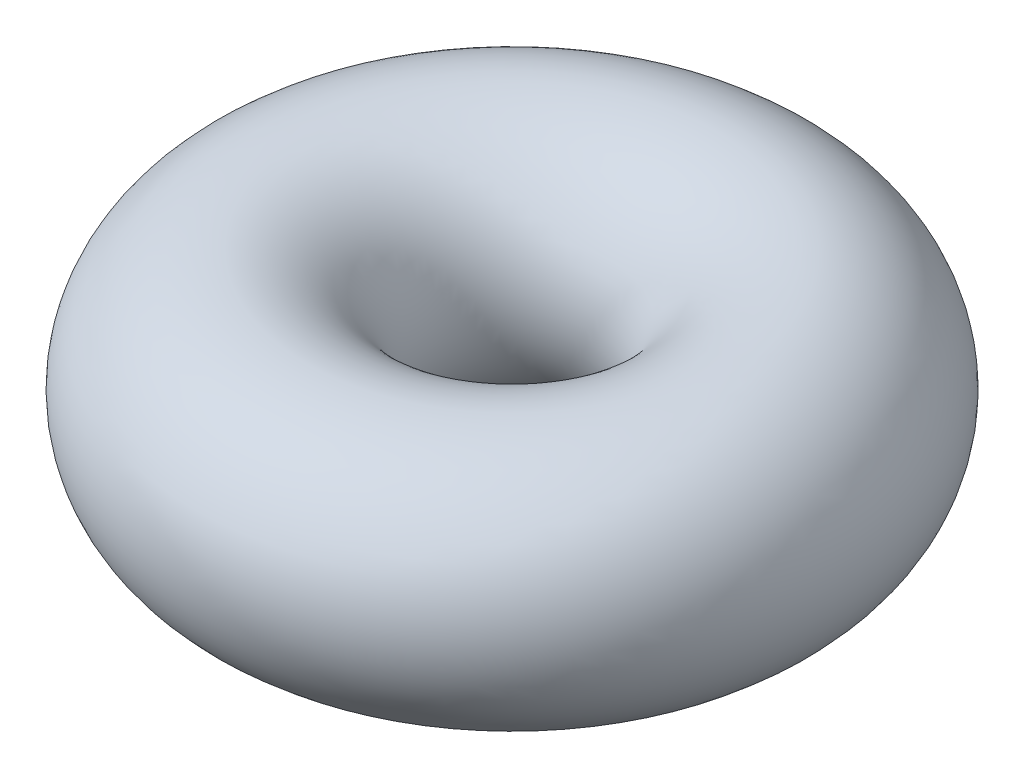
ISO-10303-21;
HEADER;
FILE_DESCRIPTION(('STEP AP214'),'2;1');
FILE_NAME('part.step','',(''),(''),'','','');
FILE_SCHEMA(('AUTOMOTIVE_DESIGN { 1 0 10303 214 1 1 1 1 }'));
ENDSEC;
DATA;
#1=APPLICATION_CONTEXT('core data for automotive mechanical design processes');
#2=APPLICATION_PROTOCOL_DEFINITION('international standard','automotive_design',2000,#1);
#3=PRODUCT_CONTEXT('',#1,'mechanical');
#4=PRODUCT('Part','Part','',(#3));
#5=PRODUCT_RELATED_PRODUCT_CATEGORY('part','',(#4));
#6=PRODUCT_DEFINITION_FORMATION('','',#4);
#7=PRODUCT_DEFINITION_CONTEXT('part definition',#1,'design');
#8=PRODUCT_DEFINITION('design','',#6,#7);
#9=PRODUCT_DEFINITION_SHAPE('','',#8);
#10=(LENGTH_UNIT() NAMED_UNIT(*) SI_UNIT(.MILLI.,.METRE.));
#11=(NAMED_UNIT(*) PLANE_ANGLE_UNIT() SI_UNIT($,.RADIAN.));
#12=(NAMED_UNIT(*) SI_UNIT($,.STERADIAN.) SOLID_ANGLE_UNIT());
#13=UNCERTAINTY_MEASURE_WITH_UNIT(LENGTH_MEASURE(1.E-05),#10,'distance_accuracy_value','');
#14=(GEOMETRIC_REPRESENTATION_CONTEXT(3) GLOBAL_UNCERTAINTY_ASSIGNED_CONTEXT((#13)) GLOBAL_UNIT_ASSIGNED_CONTEXT((#10,
#11,#12)) REPRESENTATION_CONTEXT('',''));
#15=CARTESIAN_POINT('',(0.,0.,0.));
#16=DIRECTION('',(0.,0.,1.));
#17=DIRECTION('',(1.,0.,0.));
#18=AXIS2_PLACEMENT_3D('',#15,#16,#17);
#19=CARTESIAN_POINT('',(0.,0.,0.));
#20=DIRECTION('',(0.,1.,0.));
#21=DIRECTION('',(0.,0.,1.));
#22=AXIS2_PLACEMENT_3D('',#19,#20,#21);
#23=TOROIDAL_SURFACE('',#22,4.,2.375);
#24=CARTESIAN_POINT('',(0.,0.,6.375));
#25=VERTEX_POINT('',#24);
#26=VERTEX_LOOP('',#25);
#27=FACE_BOUND('',#26,.T.);
#28=ADVANCED_FACE('F26',(#27),#23,.T.);
#29=CLOSED_SHELL('',(#28));
#30=MANIFOLD_SOLID_BREP('B2',#29);
#31=ADVANCED_BREP_SHAPE_REPRESENTATION('',(#18,#30),#14);
#32=SHAPE_DEFINITION_REPRESENTATION(#9,#31);
ENDSEC;
END-ISO-10303-21;
